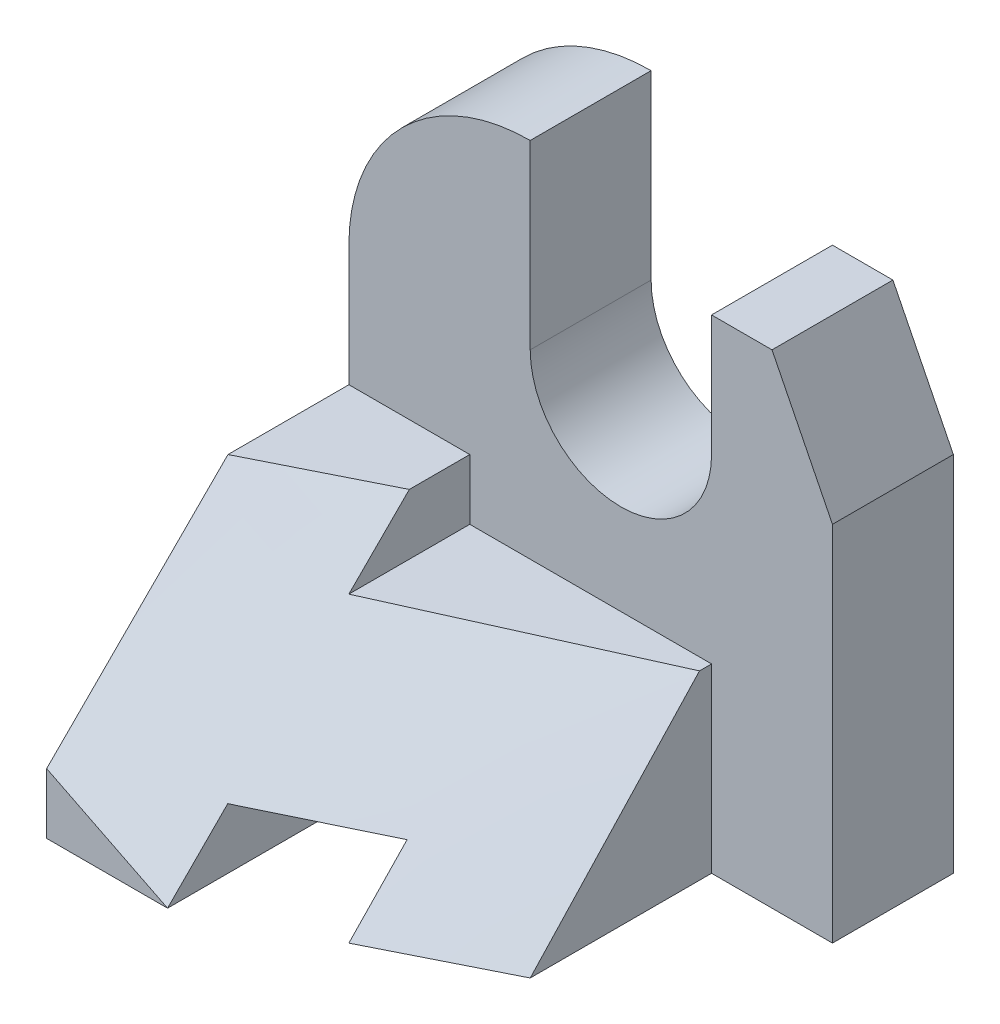
ISO-10303-21;
HEADER;
FILE_DESCRIPTION(('STEP AP214'),'2;1');
FILE_NAME('part.step','',(''),(''),'','','');
FILE_SCHEMA(('AUTOMOTIVE_DESIGN { 1 0 10303 214 1 1 1 1 }'));
ENDSEC;
DATA;
#1=APPLICATION_CONTEXT('core data for automotive mechanical design processes');
#2=APPLICATION_PROTOCOL_DEFINITION('international standard','automotive_design',2000,#1);
#3=PRODUCT_CONTEXT('',#1,'mechanical');
#4=PRODUCT('Part','Part','',(#3));
#5=PRODUCT_RELATED_PRODUCT_CATEGORY('part','',(#4));
#6=PRODUCT_DEFINITION_FORMATION('','',#4);
#7=PRODUCT_DEFINITION_CONTEXT('part definition',#1,'design');
#8=PRODUCT_DEFINITION('design','',#6,#7);
#9=PRODUCT_DEFINITION_SHAPE('','',#8);
#10=(LENGTH_UNIT() NAMED_UNIT(*) SI_UNIT(.MILLI.,.METRE.));
#11=(NAMED_UNIT(*) PLANE_ANGLE_UNIT() SI_UNIT($,.RADIAN.));
#12=(NAMED_UNIT(*) SI_UNIT($,.STERADIAN.) SOLID_ANGLE_UNIT());
#13=UNCERTAINTY_MEASURE_WITH_UNIT(LENGTH_MEASURE(1.E-05),#10,'distance_accuracy_value','');
#14=(GEOMETRIC_REPRESENTATION_CONTEXT(3) GLOBAL_UNCERTAINTY_ASSIGNED_CONTEXT((#13)) GLOBAL_UNIT_ASSIGNED_CONTEXT((#10,
#11,#12)) REPRESENTATION_CONTEXT('',''));
#15=CARTESIAN_POINT('',(0.,0.,0.));
#16=DIRECTION('',(0.,0.,1.));
#17=DIRECTION('',(1.,0.,0.));
#18=AXIS2_PLACEMENT_3D('',#15,#16,#17);
#19=CARTESIAN_POINT('',(0.,0.,-2.));
#20=DIRECTION('',(-1.,0.,0.));
#21=DIRECTION('',(0.,0.,1.));
#22=AXIS2_PLACEMENT_3D('',#19,#20,#21);
#23=PLANE('',#22);
#24=DIRECTION('',(0.,-1.,0.));
#25=VECTOR('',#24,1.);
#26=CARTESIAN_POINT('',(0.,4.,5.));
#27=LINE('',#26,#25);
#28=CARTESIAN_POINT('',(0.,1.00011072459042,5.));
#29=VERTEX_POINT('',#28);
#30=CARTESIAN_POINT('',(0.,0.,5.));
#31=VERTEX_POINT('',#30);
#32=EDGE_CURVE('E215',#29,#31,#27,.T.);
#33=ORIENTED_EDGE('',*,*,#32,.F.);
#34=CARTESIAN_POINT('',(0.000161207109679883,4.00032591672262,2.00033292172915));
#35=CARTESIAN_POINT('',(-8.70748542080413E-05,3.8748208885301,2.12482324464586));
#36=CARTESIAN_POINT('',(-0.000150147520431066,3.74969417233962,2.24969218872042));
#37=CARTESIAN_POINT('',(-0.000133600886381143,3.49972922410863,2.49972476150458));
#38=CARTESIAN_POINT('',(-5.3978227827322E-05,3.37489099892688,2.6248883970804));
#39=CARTESIAN_POINT('',(2.02224500339157E-05,3.12504151441377,2.87504113285717));
#40=CARTESIAN_POINT('',(1.48009852519153E-05,3.0000302561367,3.00003023411232));
#41=CARTESIAN_POINT('',(6.44237481719151E-07,2.75000130898481,3.25000132395382));
#42=CARTESIAN_POINT('',(-8.09103651668495E-06,2.62498362012835,3.37498331255854));
#43=CARTESIAN_POINT('',(-2.084370382305E-05,2.37495783048475,3.6249569832379));
#44=CARTESIAN_POINT('',(-2.48610951967179E-05,2.24994972970157,3.74994866531649));
#45=CARTESIAN_POINT('',(-3.41480072590862E-05,1.99993093789917,3.99992950237374));
#46=CARTESIAN_POINT('',(-3.9417528269529E-05,1.87492024687929,4.12491865735174));
#47=CARTESIAN_POINT('',(-4.0730232598206E-05,1.62491751996357,4.37491601936707));
#48=CARTESIAN_POINT('',(-3.67734014283617E-05,1.49992548409731,4.499924226434));
#49=CARTESIAN_POINT('',(-1.03988304271188E-05,1.2499787352756,4.7499787656724));
#50=CARTESIAN_POINT('',(1.2018970142933E-05,1.12502402244429,4.87502509796795));
#51=CARTESIAN_POINT('',(4.82845584500575E-05,1.00009761818244,5.00009971631353));
#52=B_SPLINE_CURVE_WITH_KNOTS('',3,(#34,#35,#36,#37,#38,#39,#40,#41,#42,#43,#44,#45,#46,#47,#48,
#49,#50,#51),.UNSPECIFIED.,.F.,.F.,(4,2,2,2,2,2,2,2,4),(0.,0.530321583229897,1.06065564754297,
1.5909864946455,2.12131590306239,2.6516455289099,3.18197529102901,3.71230588592193,
4.24263822566876),.UNSPECIFIED.);
#53=CARTESIAN_POINT('',(0.,4.,2.00036833737386));
#54=VERTEX_POINT('',#53);
#55=EDGE_CURVE('E52',#54,#29,#52,.T.);
#56=ORIENTED_EDGE('',*,*,#55,.F.);
#57=DIRECTION('',(0.,0.,-1.));
#58=VECTOR('',#57,1.);
#59=CARTESIAN_POINT('',(0.,4.,5.));
#60=LINE('',#59,#58);
#61=CARTESIAN_POINT('',(0.,4.,0.));
#62=VERTEX_POINT('',#61);
#63=EDGE_CURVE('E230',#54,#62,#60,.T.);
#64=ORIENTED_EDGE('',*,*,#63,.T.);
#65=DIRECTION('',(0.,-1.,0.));
#66=VECTOR('',#65,1.);
#67=CARTESIAN_POINT('',(0.,0.,0.));
#68=LINE('',#67,#66);
#69=CARTESIAN_POINT('',(0.,6.,0.));
#70=VERTEX_POINT('',#69);
#71=EDGE_CURVE('E276',#70,#62,#68,.T.);
#72=ORIENTED_EDGE('',*,*,#71,.F.);
#73=DIRECTION('',(0.,0.,1.));
#74=VECTOR('',#73,1.);
#75=CARTESIAN_POINT('',(0.,6.,-2.));
#76=LINE('',#75,#74);
#77=CARTESIAN_POINT('',(0.,6.,-2.));
#78=VERTEX_POINT('',#77);
#79=EDGE_CURVE('E44',#78,#70,#76,.T.);
#80=ORIENTED_EDGE('',*,*,#79,.F.);
#81=DIRECTION('',(0.,-1.,0.));
#82=VECTOR('',#81,1.);
#83=CARTESIAN_POINT('',(0.,0.,-2.));
#84=LINE('',#83,#82);
#85=CARTESIAN_POINT('',(0.,0.,-2.));
#86=VERTEX_POINT('',#85);
#87=EDGE_CURVE('E309',#78,#86,#84,.T.);
#88=ORIENTED_EDGE('',*,*,#87,.T.);
#89=DIRECTION('',(0.,0.,1.));
#90=VECTOR('',#89,1.);
#91=CARTESIAN_POINT('',(0.,0.,-2.));
#92=LINE('',#91,#90);
#93=EDGE_CURVE('E11',#86,#31,#92,.T.);
#94=ORIENTED_EDGE('',*,*,#93,.T.);
#95=EDGE_LOOP('',(#33,#56,#64,#72,#80,#88,#94));
#96=FACE_BOUND('',#95,.T.);
#97=ADVANCED_FACE('F33',(#96),#23,.T.);
#98=CARTESIAN_POINT('',(8.,0.,-2.));
#99=DIRECTION('',(0.,-1.,0.));
#100=DIRECTION('',(1.,0.,0.));
#101=AXIS2_PLACEMENT_3D('',#98,#99,#100);
#102=PLANE('',#101);
#103=DIRECTION('',(0.,0.,-1.));
#104=VECTOR('',#103,1.);
#105=CARTESIAN_POINT('',(6.,0.,5.));
#106=LINE('',#105,#104);
#107=CARTESIAN_POINT('',(6.,0.,2.99974245718688));
#108=VERTEX_POINT('',#107);
#109=CARTESIAN_POINT('',(6.,0.,0.));
#110=VERTEX_POINT('',#109);
#111=EDGE_CURVE('E187',#108,#110,#106,.T.);
#112=ORIENTED_EDGE('',*,*,#111,.F.);
#113=CARTESIAN_POINT('',(4.00000000658737,1.33178588701533E-08,4.0000000136041));
#114=CARTESIAN_POINT('',(4.08333755503595,8.52401197638786E-06,3.95834203780456));
#115=CARTESIAN_POINT('',(4.16667490731874,1.66480328938494E-05,3.9166836694744));
#116=CARTESIAN_POINT('',(4.33334909258258,3.18461884844197E-05,3.83336586036238));
#117=CARTESIAN_POINT('',(4.41668592556354,3.89203229891458E-05,3.79170641958035));
#118=CARTESIAN_POINT('',(4.58335893461497,5.17421642406971E-05,3.70838618349126));
#119=CARTESIAN_POINT('',(4.66669511068531,5.74898707313747E-05,3.66672538818393));
#120=CARTESIAN_POINT('',(4.83336686211137,6.77711544135049E-05,3.58340255743135));
#121=CARTESIAN_POINT('',(4.91670243746697,7.23047313813082E-05,3.54174052198586));
#122=CARTESIAN_POINT('',(5.08337308329097,8.03494551687727E-05,3.45841540627238));
#123=CARTESIAN_POINT('',(5.16670815375928,8.38606018176107E-05,3.41675232600421));
#124=CARTESIAN_POINT('',(5.33337769355762,8.96642436279205E-05,3.33342491980399));
#125=CARTESIAN_POINT('',(5.41671216288752,9.1956738536444E-05,3.29176059387168));
#126=CARTESIAN_POINT('',(5.58338002481438,9.43525023961884E-05,3.20842970266921));
#127=CARTESIAN_POINT('',(5.66671341741088,9.44557704495083E-05,3.16676313739815));
#128=CARTESIAN_POINT('',(5.83337726039701,8.87139680875217E-05,3.08342393066843));
#129=CARTESIAN_POINT('',(5.91670771078384,8.28688921640685E-05,3.04175128920419));
#130=CARTESIAN_POINT('',(6.00003569724967,7.21700838231021E-05,3.0000737212528));
#131=B_SPLINE_CURVE_WITH_KNOTS('',3,(#113,#114,#115,#116,#117,#118,#119,#120,#121,#122,#123,
#124,#125,#126,#127,#128,#129,#130),.UNSPECIFIED.,.F.,.F.,(4,2,2,2,2,2,2,2,4),(0.,
0.279508150185694,0.559016345199323,0.838524594188939,1.11803289466546,1.39754124184095,
1.67704964703228,1.95655816686265,2.23606694551723),.UNSPECIFIED.);
#132=CARTESIAN_POINT('',(4.00000000263495,5.32714370662588E-09,4.00000000544164));
#133=VERTEX_POINT('',#132);
#134=EDGE_CURVE('E166',#133,#108,#131,.T.);
#135=ORIENTED_EDGE('',*,*,#134,.F.);
#136=DIRECTION('',(0.,0.,1.));
#137=VECTOR('',#136,1.);
#138=CARTESIAN_POINT('',(4.,0.,-2.));
#139=LINE('',#138,#137);
#140=CARTESIAN_POINT('',(4.,0.,-2.));
#141=VERTEX_POINT('',#140);
#142=EDGE_CURVE('E343',#141,#133,#139,.T.);
#143=ORIENTED_EDGE('',*,*,#142,.F.);
#144=DIRECTION('',(1.,0.,0.));
#145=VECTOR('',#144,1.);
#146=CARTESIAN_POINT('',(8.,0.,-2.));
#147=LINE('',#146,#145);
#148=CARTESIAN_POINT('',(8.,0.,-2.));
#149=VERTEX_POINT('',#148);
#150=EDGE_CURVE('E285',#141,#149,#147,.T.);
#151=ORIENTED_EDGE('',*,*,#150,.T.);
#152=DIRECTION('',(0.,0.,1.));
#153=VECTOR('',#152,1.);
#154=CARTESIAN_POINT('',(8.,0.,-2.));
#155=LINE('',#154,#153);
#156=CARTESIAN_POINT('',(8.,0.,0.));
#157=VERTEX_POINT('',#156);
#158=EDGE_CURVE('E341',#149,#157,#155,.T.);
#159=ORIENTED_EDGE('',*,*,#158,.T.);
#160=DIRECTION('',(1.,0.,0.));
#161=VECTOR('',#160,1.);
#162=CARTESIAN_POINT('',(8.,0.,0.));
#163=LINE('',#162,#161);
#164=EDGE_CURVE('E196',#110,#157,#163,.T.);
#165=ORIENTED_EDGE('',*,*,#164,.F.);
#166=EDGE_LOOP('',(#112,#135,#143,#151,#159,#165));
#167=FACE_BOUND('',#166,.T.);
#168=ADVANCED_FACE('F194',(#167),#102,.T.);
#169=CARTESIAN_POINT('',(4.,1.,-2.));
#170=DIRECTION('',(-1.,0.,0.));
#171=DIRECTION('',(0.,0.,1.));
#172=AXIS2_PLACEMENT_3D('',#169,#170,#171);
#173=PLANE('',#172);
#174=ORIENTED_EDGE('',*,*,#142,.T.);
#175=CARTESIAN_POINT('',(4.,0.,4.00000002980032));
#176=CARTESIAN_POINT('',(4.,0.0830768448448193,3.91950210453213));
#177=CARTESIAN_POINT('',(4.,0.166228998184829,3.83908195098269));
#178=CARTESIAN_POINT('',(4.,0.332668683019209,3.67838219701719));
#179=CARTESIAN_POINT('',(4.,0.415956214230219,3.59810259630767));
#180=CARTESIAN_POINT('',(4.,0.582651747515637,3.43766863660996));
#181=CARTESIAN_POINT('',(4.,0.666059749567043,3.35751427759786));
#182=CARTESIAN_POINT('',(4.,0.83296791855962,3.19730121540335));
#183=CARTESIAN_POINT('',(4.,0.91646808569309,3.11724251242126));
#184=CARTESIAN_POINT('',(4.00000000000001,1.,3.03721701965413));
#185=B_SPLINE_CURVE_WITH_KNOTS('',3,(#175,#176,#177,#178,#179,#180,#181,#182,#183,#184),
.UNSPECIFIED.,.F.,.F.,(4,2,2,2,4),(0.,0.347037511652203,0.69407429784966,1.04111101779322,
1.38814846319167),.UNSPECIFIED.);
#186=CARTESIAN_POINT('',(4.,1.,3.03721701965413));
#187=VERTEX_POINT('',#186);
#188=EDGE_CURVE('E174',#133,#187,#185,.T.);
#189=ORIENTED_EDGE('',*,*,#188,.T.);
#190=DIRECTION('',(0.,0.,1.));
#191=VECTOR('',#190,1.);
#192=CARTESIAN_POINT('',(4.,1.,-2.));
#193=LINE('',#192,#191);
#194=CARTESIAN_POINT('',(4.,1.,-2.));
#195=VERTEX_POINT('',#194);
#196=EDGE_CURVE('E345',#195,#187,#193,.T.);
#197=ORIENTED_EDGE('',*,*,#196,.F.);
#198=DIRECTION('',(0.,-1.,0.));
#199=VECTOR('',#198,1.);
#200=CARTESIAN_POINT('',(4.,1.,-2.));
#201=LINE('',#200,#199);
#202=EDGE_CURVE('E282',#195,#141,#201,.T.);
#203=ORIENTED_EDGE('',*,*,#202,.T.);
#204=EDGE_LOOP('',(#174,#189,#197,#203));
#205=FACE_BOUND('',#204,.T.);
#206=ADVANCED_FACE('F362',(#205),#173,.T.);
#207=CARTESIAN_POINT('',(2.,1.,-2.));
#208=DIRECTION('',(0.,-1.,0.));
#209=DIRECTION('',(0.,0.,-1.));
#210=AXIS2_PLACEMENT_3D('',#207,#208,#209);
#211=PLANE('',#210);
#212=ORIENTED_EDGE('',*,*,#196,.T.);
#213=CARTESIAN_POINT('',(4.,1.,3.03721701965413));
#214=CARTESIAN_POINT('',(3.83317542959914,1.,3.11743675421449));
#215=CARTESIAN_POINT('',(3.66629841694291,1.,3.19754754200068));
#216=CARTESIAN_POINT('',(3.33258330217989,1.,3.35784822255746));
#217=CARTESIAN_POINT('',(3.16574519990884,1.,3.43803811498633));
#218=CARTESIAN_POINT('',(2.83225001478325,1.,3.59879480818127));
#219=CARTESIAN_POINT('',(2.66559293219904,1.,3.67936160950925));
#220=CARTESIAN_POINT('',(2.33256009502068,1.,3.84107609590735));
#221=CARTESIAN_POINT('',(2.16618434163963,1.,3.92222378347442));
#222=CARTESIAN_POINT('',(2.,1.,4.00376361602445));
#223=B_SPLINE_CURVE_WITH_KNOTS('',3,(#213,#214,#215,#216,#217,#218,#219,#220,#221,#222),
.UNSPECIFIED.,.F.,.F.,(4,2,2,2,4),(0.,0.555329578273566,1.11065676801888,1.66598478593238,
2.22131519237057),.UNSPECIFIED.);
#224=CARTESIAN_POINT('',(2.,1.,4.00376361602445));
#225=VERTEX_POINT('',#224);
#226=EDGE_CURVE('E427',#187,#225,#223,.T.);
#227=ORIENTED_EDGE('',*,*,#226,.T.);
#228=DIRECTION('',(0.,0.,1.));
#229=VECTOR('',#228,1.);
#230=CARTESIAN_POINT('',(2.,1.,-2.));
#231=LINE('',#230,#229);
#232=CARTESIAN_POINT('',(2.,1.,-2.));
#233=VERTEX_POINT('',#232);
#234=EDGE_CURVE('E318',#233,#225,#231,.T.);
#235=ORIENTED_EDGE('',*,*,#234,.F.);
#236=DIRECTION('',(1.,0.,0.));
#237=VECTOR('',#236,1.);
#238=CARTESIAN_POINT('',(2.,1.,-2.));
#239=LINE('',#238,#237);
#240=EDGE_CURVE('E279',#233,#195,#239,.T.);
#241=ORIENTED_EDGE('',*,*,#240,.T.);
#242=EDGE_LOOP('',(#212,#227,#235,#241));
#243=FACE_BOUND('',#242,.T.);
#244=ADVANCED_FACE('F368',(#243),#211,.T.);
#245=CARTESIAN_POINT('',(2.,0.,-2.));
#246=DIRECTION('',(1.,0.,0.));
#247=DIRECTION('',(0.,0.,-1.));
#248=AXIS2_PLACEMENT_3D('',#245,#246,#247);
#249=PLANE('',#248);
#250=ORIENTED_EDGE('',*,*,#234,.T.);
#251=CARTESIAN_POINT('',(2.,1.,4.00376361602445));
#252=CARTESIAN_POINT('',(2.,0.666666666666666,4.33577798385316));
#253=CARTESIAN_POINT('',(2.,0.333333333333331,4.66779235168187));
#254=CARTESIAN_POINT('',(2.,0.,4.99980671951058));
#255=B_SPLINE_CURVE_WITH_KNOTS('',3,(#251,#252,#253,#254),.UNSPECIFIED.,.F.,.F.,(4,4),(0.,
1.41141838729779),.UNSPECIFIED.);
#256=CARTESIAN_POINT('',(1.99999443737516,0.,4.99990862702491));
#257=VERTEX_POINT('',#256);
#258=EDGE_CURVE('E179',#225,#257,#255,.T.);
#259=ORIENTED_EDGE('',*,*,#258,.T.);
#260=DIRECTION('',(0.,0.,1.));
#261=VECTOR('',#260,1.);
#262=CARTESIAN_POINT('',(2.,0.,-2.));
#263=LINE('',#262,#261);
#264=CARTESIAN_POINT('',(2.,0.,-2.));
#265=VERTEX_POINT('',#264);
#266=EDGE_CURVE('E312',#265,#257,#263,.T.);
#267=ORIENTED_EDGE('',*,*,#266,.F.);
#268=DIRECTION('',(0.,1.,0.));
#269=VECTOR('',#268,1.);
#270=CARTESIAN_POINT('',(2.,0.,-2.));
#271=LINE('',#270,#269);
#272=EDGE_CURVE('E275',#265,#233,#271,.T.);
#273=ORIENTED_EDGE('',*,*,#272,.T.);
#274=EDGE_LOOP('',(#250,#259,#267,#273));
#275=FACE_BOUND('',#274,.T.);
#276=ADVANCED_FACE('F438',(#275),#249,.T.);
#277=CARTESIAN_POINT('',(6.,0.,5.));
#278=DIRECTION('',(-1.,0.,0.));
#279=DIRECTION('',(0.,0.,1.));
#280=AXIS2_PLACEMENT_3D('',#277,#278,#279);
#281=PLANE('',#280);
#282=CARTESIAN_POINT('',(6.00003569724967,7.21700838224092E-05,3.0000737212528));
#283=CARTESIAN_POINT('',(5.9999663052207,0.124934053161901,2.88325711398926));
#284=CARTESIAN_POINT('',(5.99995070152583,0.249901980075695,2.76655411080573));
#285=CARTESIAN_POINT('',(5.99996420301007,0.499928223040762,2.53324043630837));
#286=CARTESIAN_POINT('',(5.99999330899141,0.624986540673685,2.41662976668887));
#287=CARTESIAN_POINT('',(6.00003335995744,0.87506703695138,2.18337038261943));
#288=CARTESIAN_POINT('',(6.00004430499147,1.00008921569344,2.06672166827374));
#289=CARTESIAN_POINT('',(6.00005410570267,1.25010915478673,1.83339925142854));
#290=CARTESIAN_POINT('',(6.00005296143682,1.37510691525025,1.71672554904936));
#291=CARTESIAN_POINT('',(6.00004728832248,1.62509554499609,1.48337119976784));
#292=CARTESIAN_POINT('',(6.00004275947989,1.75008641429003,1.36669055287793));
#293=CARTESIAN_POINT('',(6.00003336996312,2.00006762718836,1.13332843829637));
#294=CARTESIAN_POINT('',(6.0000285092886,2.12505797079209,1.016646970604));
#295=CARTESIAN_POINT('',(6.00003886240315,2.37507860726888,0.783326086050125));
#296=CARTESIAN_POINT('',(6.00005407625179,2.50010890025937,0.666686669314432));
#297=CARTESIAN_POINT('',(6.00004869024947,2.750097080772,0.433333874057769));
#298=CARTESIAN_POINT('',(6.00002809090985,2.87505496930246,0.316620496616601));
#299=CARTESIAN_POINT('',(5.99996164225678,2.99992245112525,0.199810296460821));
#300=B_SPLINE_CURVE_WITH_KNOTS('',3,(#282,#283,#284,#285,#286,#287,#288,#289,#290,#291,#292,
#293,#294,#295,#296,#297,#298,#299),.UNSPECIFIED.,.F.,.F.,(4,2,2,2,2,2,2,2,4),(0.,
0.512961207217331,1.02593161868379,1.53890063609428,2.0518672361939,2.56483294425948,
3.07779917985295,3.59076693756888,4.10372737115164),.UNSPECIFIED.);
#301=CARTESIAN_POINT('',(6.,3.,0.199804984205686));
#302=VERTEX_POINT('',#301);
#303=EDGE_CURVE('E170',#108,#302,#300,.T.);
#304=ORIENTED_EDGE('',*,*,#303,.F.);
#305=ORIENTED_EDGE('',*,*,#111,.T.);
#306=DIRECTION('',(0.,1.,0.));
#307=VECTOR('',#306,1.);
#308=CARTESIAN_POINT('',(6.,0.,0.));
#309=LINE('',#308,#307);
#310=CARTESIAN_POINT('',(6.,3.,0.));
#311=VERTEX_POINT('',#310);
#312=EDGE_CURVE('E323',#110,#311,#309,.T.);
#313=ORIENTED_EDGE('',*,*,#312,.T.);
#314=DIRECTION('',(0.,0.,-1.));
#315=VECTOR('',#314,1.);
#316=CARTESIAN_POINT('',(6.,3.,5.));
#317=LINE('',#316,#315);
#318=EDGE_CURVE('E189',#302,#311,#317,.T.);
#319=ORIENTED_EDGE('',*,*,#318,.F.);
#320=EDGE_LOOP('',(#304,#305,#313,#319));
#321=FACE_BOUND('',#320,.T.);
#322=ADVANCED_FACE('F185',(#321),#281,.F.);
#323=CARTESIAN_POINT('',(6.,3.,5.));
#324=DIRECTION('',(0.,-1.,0.));
#325=DIRECTION('',(0.,0.,-1.));
#326=AXIS2_PLACEMENT_3D('',#323,#324,#325);
#327=PLANE('',#326);
#328=CARTESIAN_POINT('',(5.99996164225678,2.99992245112525,0.199810296460821));
#329=CARTESIAN_POINT('',(5.83329132696436,2.99991470447445,0.274806904582816));
#330=CARTESIAN_POINT('',(5.66662405256221,2.99991348834526,0.349810268769717));
#331=CARTESIAN_POINT('',(5.33329532676501,2.99992282861731,0.499829022704072));
#332=CARTESIAN_POINT('',(5.16663387535874,2.99993338499444,0.574844412426582));
#333=CARTESIAN_POINT('',(4.83331613932615,2.99996498171812,0.72488590966804));
#334=CARTESIAN_POINT('',(4.66665985469149,2.99998602204673,0.799912017168425));
#335=CARTESIAN_POINT('',(4.33334997944098,3.00003367147151,0.949969947828286));
#336=CARTESIAN_POINT('',(4.16669638882368,3.00006028056456,1.02500177098454));
#337=CARTESIAN_POINT('',(3.83338237422125,3.00010015820654,1.17505189567828));
#338=CARTESIAN_POINT('',(3.66672195021388,3.00011342670789,1.25007019716659));
#339=CARTESIAN_POINT('',(3.33336338345372,3.00006435711618,1.40002971329459));
#340=CARTESIAN_POINT('',(3.16666524015249,3.00000201784229,1.47497092671206));
#341=CARTESIAN_POINT('',(2.83316753849596,2.99966395311703,1.62463352174489));
#342=CARTESIAN_POINT('',(2.6663679789467,2.99938822510285,1.69935490070921));
#343=CARTESIAN_POINT('',(2.33303299064084,2.99937077389548,1.84934314196292));
#344=CARTESIAN_POINT('',(2.16649753974268,2.99962900328016,1.9246099552193));
#345=CARTESIAN_POINT('',(2.00026105623664,3.00052778437151,2.00053912816797));
#346=B_SPLINE_CURVE_WITH_KNOTS('',3,(#328,#329,#330,#331,#332,#333,#334,#335,#336,#337,#338,
#339,#340,#341,#342,#343,#344,#345),.UNSPECIFIED.,.F.,.F.,(4,2,2,2,2,2,2,2,4),(0.,
0.548298609430597,1.09659609597028,1.64489264419368,2.19318888583376,2.74148708243618,
3.2897938422599,3.83810718736393,4.38637183744746),.UNSPECIFIED.);
#347=CARTESIAN_POINT('',(2.,3.,2.00059483053786));
#348=VERTEX_POINT('',#347);
#349=EDGE_CURVE('E190',#302,#348,#346,.T.);
#350=ORIENTED_EDGE('',*,*,#349,.F.);
#351=ORIENTED_EDGE('',*,*,#318,.T.);
#352=DIRECTION('',(-1.,0.,0.));
#353=VECTOR('',#352,1.);
#354=CARTESIAN_POINT('',(6.,3.,0.));
#355=LINE('',#354,#353);
#356=CARTESIAN_POINT('',(2.,3.,0.));
#357=VERTEX_POINT('',#356);
#358=EDGE_CURVE('E557',#311,#357,#355,.T.);
#359=ORIENTED_EDGE('',*,*,#358,.T.);
#360=DIRECTION('',(0.,0.,-1.));
#361=VECTOR('',#360,1.);
#362=CARTESIAN_POINT('',(2.,3.,5.));
#363=LINE('',#362,#361);
#364=EDGE_CURVE('E199',#348,#357,#363,.T.);
#365=ORIENTED_EDGE('',*,*,#364,.F.);
#366=EDGE_LOOP('',(#350,#351,#359,#365));
#367=FACE_BOUND('',#366,.T.);
#368=ADVANCED_FACE('F257',(#367),#327,.F.);
#369=CARTESIAN_POINT('',(2.,3.,5.));
#370=DIRECTION('',(-1.,0.,0.));
#371=DIRECTION('',(0.,0.,1.));
#372=AXIS2_PLACEMENT_3D('',#369,#370,#371);
#373=PLANE('',#372);
#374=CARTESIAN_POINT('',(2.00026105623664,3.00052778437151,2.00053912816797));
#375=CARTESIAN_POINT('',(2.00023106367735,3.04213368761931,1.95881064812215));
#376=CARTESIAN_POINT('',(2.0002065855731,3.08375087561613,1.91709342039173));
#377=CARTESIAN_POINT('',(2.00016662047752,3.16700342918406,1.8336775331982));
#378=CARTESIAN_POINT('',(2.00015113343962,3.20863879465989,1.79197887364002));
#379=CARTESIAN_POINT('',(2.00012711245752,3.29192358139359,1.70859591538839));
#380=CARTESIAN_POINT('',(2.00011857848643,3.33357300259649,1.66691161664003));
#381=CARTESIAN_POINT('',(2.00010653438562,3.41688200048406,1.58355339563352));
#382=CARTESIAN_POINT('',(2.00010302424218,3.45854157714072,1.54187947334738));
#383=CARTESIAN_POINT('',(2.00009934309266,3.54186747955726,1.45853852641536));
#384=CARTESIAN_POINT('',(2.00009917208057,3.58353380530491,1.41687150175725));
#385=CARTESIAN_POINT('',(2.00010087272911,3.66687058479905,1.33354167265536));
#386=CARTESIAN_POINT('',(2.00010274438747,3.70854103854095,1.29187886820698));
#387=CARTESIAN_POINT('',(2.00010767958044,3.7918843527374,1.20855572368482));
#388=CARTESIAN_POINT('',(2.00011074311423,3.83355721319028,1.16689538360937));
#389=CARTESIAN_POINT('',(2.00011802400207,3.91690526680533,1.08357708630521));
#390=CARTESIAN_POINT('',(2.00012224135544,3.95858045996611,1.04191912907511));
#391=CARTESIAN_POINT('',(2.00012701659245,4.00025679284004,1.00026231215032));
#392=B_SPLINE_CURVE_WITH_KNOTS('',3,(#374,#375,#376,#377,#378,#379,#380,#381,#382,#383,#384,
#385,#386,#387,#388,#389,#390,#391),.UNSPECIFIED.,.F.,.F.,(4,2,2,2,2,2,2,2,4),(0.,
0.176779129581848,0.353557343388286,0.530334873640979,0.707111921800777,0.883888652814245,
1.06066518936698,1.23744160508056,1.41421791643286),.UNSPECIFIED.);
#393=CARTESIAN_POINT('',(2.,4.,1.00029066476479));
#394=VERTEX_POINT('',#393);
#395=EDGE_CURVE('E556',#348,#394,#392,.T.);
#396=ORIENTED_EDGE('',*,*,#395,.F.);
#397=ORIENTED_EDGE('',*,*,#364,.T.);
#398=DIRECTION('',(0.,1.,0.));
#399=VECTOR('',#398,1.);
#400=CARTESIAN_POINT('',(2.,3.,0.));
#401=LINE('',#400,#399);
#402=CARTESIAN_POINT('',(2.,4.,0.));
#403=VERTEX_POINT('',#402);
#404=EDGE_CURVE('E216',#357,#403,#401,.T.);
#405=ORIENTED_EDGE('',*,*,#404,.T.);
#406=DIRECTION('',(0.,0.,-1.));
#407=VECTOR('',#406,1.);
#408=CARTESIAN_POINT('',(2.,4.,5.));
#409=LINE('',#408,#407);
#410=EDGE_CURVE('E61',#394,#403,#409,.T.);
#411=ORIENTED_EDGE('',*,*,#410,.F.);
#412=EDGE_LOOP('',(#396,#397,#405,#411));
#413=FACE_BOUND('',#412,.T.);
#414=ADVANCED_FACE('F251',(#413),#373,.F.);
#415=CARTESIAN_POINT('',(2.,4.,5.));
#416=DIRECTION('',(0.,-1.,0.));
#417=DIRECTION('',(0.,0.,-1.));
#418=AXIS2_PLACEMENT_3D('',#415,#416,#417);
#419=PLANE('',#418);
#420=CARTESIAN_POINT('',(2.00012701659245,4.00025679284004,1.00026231215032));
#421=CARTESIAN_POINT('',(1.91663704188144,3.9999426485297,1.04160871113607));
#422=CARTESIAN_POINT('',(1.83322103049211,3.99977509883147,1.08310412867022));
#423=CARTESIAN_POINT('',(1.66647009642934,3.99960393870713,1.16626242660867));
#424=CARTESIAN_POINT('',(1.58313517547372,3.99960033168152,1.20792531046863));
#425=CARTESIAN_POINT('',(1.41648239760115,3.99962780936508,1.29128656327078));
#426=CARTESIAN_POINT('',(1.33316454082123,3.99965889434273,1.33298493248509));
#427=CARTESIAN_POINT('',(1.16652745393708,3.99971846180564,1.41637905551638));
#428=CARTESIAN_POINT('',(1.08320822383238,3.99974694429,1.45807480933246));
#429=CARTESIAN_POINT('',(0.916564101102666,3.99979253729715,1.54145471940505));
#430=CARTESIAN_POINT('',(0.833239208485254,3.99980964783491,1.58313887567674));
#431=CARTESIAN_POINT('',(0.666588910661748,3.99984286801782,1.66650617457534));
#432=CARTESIAN_POINT('',(0.583263505455616,3.9998589776629,1.70818931720218));
#433=CARTESIAN_POINT('',(0.416621543800783,3.99990924002552,1.79157407124629));
#434=CARTESIAN_POINT('',(0.333304987385586,3.99994339280911,1.83327568273062));
#435=CARTESIAN_POINT('',(0.1667033986068,4.0000754314226,1.91674400858235));
#436=CARTESIAN_POINT('',(0.0834183666033845,4.00017331795992,1.95851072366725));
#437=CARTESIAN_POINT('',(0.000161207109680718,4.00032591672262,2.00033292172915));
#438=B_SPLINE_CURVE_WITH_KNOTS('',3,(#420,#421,#422,#423,#424,#425,#426,#427,#428,#429,#430,
#431,#432,#433,#434,#435,#436,#437),.UNSPECIFIED.,.F.,.F.,(4,2,2,2,2,2,2,2,4),(0.,
0.2795016352495,0.559009067900931,0.838518663569686,1.11802835642197,1.39753768155196,
1.67704702653647,1.95655739461351,2.23607086518479),.UNSPECIFIED.);
#439=EDGE_CURVE('E234',#394,#54,#438,.T.);
#440=ORIENTED_EDGE('',*,*,#439,.F.);
#441=ORIENTED_EDGE('',*,*,#410,.T.);
#442=DIRECTION('',(-1.,0.,0.));
#443=VECTOR('',#442,1.);
#444=CARTESIAN_POINT('',(2.,4.,0.));
#445=LINE('',#444,#443);
#446=EDGE_CURVE('E212',#403,#62,#445,.T.);
#447=ORIENTED_EDGE('',*,*,#446,.T.);
#448=ORIENTED_EDGE('',*,*,#63,.F.);
#449=EDGE_LOOP('',(#440,#441,#447,#448));
#450=FACE_BOUND('',#449,.T.);
#451=ADVANCED_FACE('F240',(#450),#419,.F.);
#452=CARTESIAN_POINT('',(3.,6.,0.));
#453=DIRECTION('',(0.,0.,-1.));
#454=DIRECTION('',(-1.,0.,0.));
#455=AXIS2_PLACEMENT_3D('',#452,#453,#454);
#456=PLANE('',#455);
#457=ORIENTED_EDGE('',*,*,#446,.F.);
#458=ORIENTED_EDGE('',*,*,#404,.F.);
#459=ORIENTED_EDGE('',*,*,#358,.F.);
#460=ORIENTED_EDGE('',*,*,#312,.F.);
#461=ORIENTED_EDGE('',*,*,#164,.T.);
#462=DIRECTION('',(0.,1.,0.));
#463=VECTOR('',#462,1.);
#464=CARTESIAN_POINT('',(8.,6.,0.));
#465=LINE('',#464,#463);
#466=CARTESIAN_POINT('',(8.,6.,0.));
#467=VERTEX_POINT('',#466);
#468=EDGE_CURVE('E197',#157,#467,#465,.T.);
#469=ORIENTED_EDGE('',*,*,#468,.T.);
#470=DIRECTION('',(-0.447213595499958,0.894427190999916,0.));
#471=VECTOR('',#470,1.);
#472=CARTESIAN_POINT('',(7.,8.,0.));
#473=LINE('',#472,#471);
#474=CARTESIAN_POINT('',(7.,8.,0.));
#475=VERTEX_POINT('',#474);
#476=EDGE_CURVE('E482',#467,#475,#473,.T.);
#477=ORIENTED_EDGE('',*,*,#476,.T.);
#478=DIRECTION('',(-1.,0.,0.));
#479=VECTOR('',#478,1.);
#480=CARTESIAN_POINT('',(6.,8.,0.));
#481=LINE('',#480,#479);
#482=CARTESIAN_POINT('',(6.,8.,0.));
#483=VERTEX_POINT('',#482);
#484=EDGE_CURVE('E480',#475,#483,#481,.T.);
#485=ORIENTED_EDGE('',*,*,#484,.T.);
#486=DIRECTION('',(0.,-1.,0.));
#487=VECTOR('',#486,1.);
#488=CARTESIAN_POINT('',(6.,6.,0.));
#489=LINE('',#488,#487);
#490=CARTESIAN_POINT('',(6.,6.,0.));
#491=VERTEX_POINT('',#490);
#492=EDGE_CURVE('E475',#483,#491,#489,.T.);
#493=ORIENTED_EDGE('',*,*,#492,.T.);
#494=CARTESIAN_POINT('',(4.5,6.,0.));
#495=DIRECTION('',(0.,0.,-1.));
#496=DIRECTION('',(1.,0.,0.));
#497=AXIS2_PLACEMENT_3D('',#494,#495,#496);
#498=CIRCLE('',#497,1.5);
#499=CARTESIAN_POINT('',(3.,6.,0.));
#500=VERTEX_POINT('',#499);
#501=EDGE_CURVE('E474',#491,#500,#498,.T.);
#502=ORIENTED_EDGE('',*,*,#501,.T.);
#503=DIRECTION('',(0.,1.,0.));
#504=VECTOR('',#503,1.);
#505=CARTESIAN_POINT('',(3.,9.,0.));
#506=LINE('',#505,#504);
#507=CARTESIAN_POINT('',(3.,9.,0.));
#508=VERTEX_POINT('',#507);
#509=EDGE_CURVE('E472',#500,#508,#506,.T.);
#510=ORIENTED_EDGE('',*,*,#509,.T.);
#511=CARTESIAN_POINT('',(3.,6.,0.));
#512=DIRECTION('',(0.,0.,1.));
#513=DIRECTION('',(-1.,0.,0.));
#514=AXIS2_PLACEMENT_3D('',#511,#512,#513);
#515=CIRCLE('',#514,3.);
#516=EDGE_CURVE('E322',#508,#70,#515,.T.);
#517=ORIENTED_EDGE('',*,*,#516,.T.);
#518=ORIENTED_EDGE('',*,*,#71,.T.);
#519=EDGE_LOOP('',(#457,#458,#459,#460,#461,#469,#477,#485,#493,#502,#510,#517,#518));
#520=FACE_BOUND('',#519,.T.);
#521=ADVANCED_FACE('F250',(#520),#456,.F.);
#522=CARTESIAN_POINT('',(2.,0.,-2.));
#523=DIRECTION('',(0.,-1.,0.));
#524=DIRECTION('',(1.,0.,0.));
#525=AXIS2_PLACEMENT_3D('',#522,#523,#524);
#526=PLANE('',#525);
#527=ORIENTED_EDGE('',*,*,#266,.T.);
#528=DIRECTION('',(1.,0.,0.));
#529=VECTOR('',#528,1.);
#530=CARTESIAN_POINT('',(0.,0.,5.));
#531=LINE('',#530,#529);
#532=EDGE_CURVE('E443',#31,#257,#531,.T.);
#533=ORIENTED_EDGE('',*,*,#532,.F.);
#534=ORIENTED_EDGE('',*,*,#93,.F.);
#535=DIRECTION('',(1.,0.,0.));
#536=VECTOR('',#535,1.);
#537=CARTESIAN_POINT('',(2.,0.,-2.));
#538=LINE('',#537,#536);
#539=EDGE_CURVE('E272',#86,#265,#538,.T.);
#540=ORIENTED_EDGE('',*,*,#539,.T.);
#541=EDGE_LOOP('',(#527,#533,#534,#540));
#542=FACE_BOUND('',#541,.T.);
#543=ADVANCED_FACE('F35',(#542),#526,.T.);
#544=CARTESIAN_POINT('',(3.,6.,-2.));
#545=DIRECTION('',(0.,0.,1.));
#546=DIRECTION('',(1.,0.,0.));
#547=AXIS2_PLACEMENT_3D('',#544,#545,#546);
#548=CYLINDRICAL_SURFACE('',#547,3.);
#549=ORIENTED_EDGE('',*,*,#516,.F.);
#550=DIRECTION('',(0.,0.,1.));
#551=VECTOR('',#550,1.);
#552=CARTESIAN_POINT('',(3.,9.,-2.));
#553=LINE('',#552,#551);
#554=CARTESIAN_POINT('',(3.,9.,-2.));
#555=VERTEX_POINT('',#554);
#556=EDGE_CURVE('E329',#555,#508,#553,.T.);
#557=ORIENTED_EDGE('',*,*,#556,.F.);
#558=CARTESIAN_POINT('',(3.,6.,-2.));
#559=DIRECTION('',(0.,0.,1.));
#560=DIRECTION('',(-1.,0.,0.));
#561=AXIS2_PLACEMENT_3D('',#558,#559,#560);
#562=CIRCLE('',#561,3.);
#563=EDGE_CURVE('E306',#555,#78,#562,.T.);
#564=ORIENTED_EDGE('',*,*,#563,.T.);
#565=ORIENTED_EDGE('',*,*,#79,.T.);
#566=EDGE_LOOP('',(#549,#557,#564,#565));
#567=FACE_BOUND('',#566,.T.);
#568=ADVANCED_FACE('F508',(#567),#548,.T.);
#569=CARTESIAN_POINT('',(3.,9.,-2.));
#570=DIRECTION('',(1.,0.,0.));
#571=DIRECTION('',(0.,0.,-1.));
#572=AXIS2_PLACEMENT_3D('',#569,#570,#571);
#573=PLANE('',#572);
#574=ORIENTED_EDGE('',*,*,#509,.F.);
#575=DIRECTION('',(0.,0.,1.));
#576=VECTOR('',#575,1.);
#577=CARTESIAN_POINT('',(3.,6.,-2.));
#578=LINE('',#577,#576);
#579=CARTESIAN_POINT('',(3.,6.,-2.));
#580=VERTEX_POINT('',#579);
#581=EDGE_CURVE('E331',#580,#500,#578,.T.);
#582=ORIENTED_EDGE('',*,*,#581,.F.);
#583=DIRECTION('',(0.,1.,0.));
#584=VECTOR('',#583,1.);
#585=CARTESIAN_POINT('',(3.,9.,-2.));
#586=LINE('',#585,#584);
#587=EDGE_CURVE('E303',#580,#555,#586,.T.);
#588=ORIENTED_EDGE('',*,*,#587,.T.);
#589=ORIENTED_EDGE('',*,*,#556,.T.);
#590=EDGE_LOOP('',(#574,#582,#588,#589));
#591=FACE_BOUND('',#590,.T.);
#592=ADVANCED_FACE('F506',(#591),#573,.T.);
#593=CARTESIAN_POINT('',(4.5,6.,-2.));
#594=DIRECTION('',(0.,0.,1.));
#595=DIRECTION('',(1.,0.,0.));
#596=AXIS2_PLACEMENT_3D('',#593,#594,#595);
#597=CYLINDRICAL_SURFACE('',#596,1.5);
#598=ORIENTED_EDGE('',*,*,#501,.F.);
#599=DIRECTION('',(0.,0.,1.));
#600=VECTOR('',#599,1.);
#601=CARTESIAN_POINT('',(6.,6.,-2.));
#602=LINE('',#601,#600);
#603=CARTESIAN_POINT('',(6.,6.,-2.));
#604=VERTEX_POINT('',#603);
#605=EDGE_CURVE('E333',#604,#491,#602,.T.);
#606=ORIENTED_EDGE('',*,*,#605,.F.);
#607=CARTESIAN_POINT('',(4.5,6.,-2.));
#608=DIRECTION('',(0.,0.,-1.));
#609=DIRECTION('',(1.,0.,0.));
#610=AXIS2_PLACEMENT_3D('',#607,#608,#609);
#611=CIRCLE('',#610,1.5);
#612=EDGE_CURVE('E300',#604,#580,#611,.T.);
#613=ORIENTED_EDGE('',*,*,#612,.T.);
#614=ORIENTED_EDGE('',*,*,#581,.T.);
#615=EDGE_LOOP('',(#598,#606,#613,#614));
#616=FACE_BOUND('',#615,.T.);
#617=ADVANCED_FACE('F503',(#616),#597,.F.);
#618=CARTESIAN_POINT('',(6.,6.,-2.));
#619=DIRECTION('',(-1.,0.,0.));
#620=DIRECTION('',(0.,0.,1.));
#621=AXIS2_PLACEMENT_3D('',#618,#619,#620);
#622=PLANE('',#621);
#623=ORIENTED_EDGE('',*,*,#492,.F.);
#624=DIRECTION('',(0.,0.,1.));
#625=VECTOR('',#624,1.);
#626=CARTESIAN_POINT('',(6.,8.,-2.));
#627=LINE('',#626,#625);
#628=CARTESIAN_POINT('',(6.,8.,-2.));
#629=VERTEX_POINT('',#628);
#630=EDGE_CURVE('E335',#629,#483,#627,.T.);
#631=ORIENTED_EDGE('',*,*,#630,.F.);
#632=DIRECTION('',(0.,-1.,0.));
#633=VECTOR('',#632,1.);
#634=CARTESIAN_POINT('',(6.,6.,-2.));
#635=LINE('',#634,#633);
#636=EDGE_CURVE('E297',#629,#604,#635,.T.);
#637=ORIENTED_EDGE('',*,*,#636,.T.);
#638=ORIENTED_EDGE('',*,*,#605,.T.);
#639=EDGE_LOOP('',(#623,#631,#637,#638));
#640=FACE_BOUND('',#639,.T.);
#641=ADVANCED_FACE('F499',(#640),#622,.T.);
#642=CARTESIAN_POINT('',(6.,8.,-2.));
#643=DIRECTION('',(0.,1.,0.));
#644=DIRECTION('',(0.,0.,1.));
#645=AXIS2_PLACEMENT_3D('',#642,#643,#644);
#646=PLANE('',#645);
#647=ORIENTED_EDGE('',*,*,#484,.F.);
#648=DIRECTION('',(0.,0.,1.));
#649=VECTOR('',#648,1.);
#650=CARTESIAN_POINT('',(7.,8.,-2.));
#651=LINE('',#650,#649);
#652=CARTESIAN_POINT('',(7.,8.,-2.));
#653=VERTEX_POINT('',#652);
#654=EDGE_CURVE('E337',#653,#475,#651,.T.);
#655=ORIENTED_EDGE('',*,*,#654,.F.);
#656=DIRECTION('',(-1.,0.,0.));
#657=VECTOR('',#656,1.);
#658=CARTESIAN_POINT('',(6.,8.,-2.));
#659=LINE('',#658,#657);
#660=EDGE_CURVE('E294',#653,#629,#659,.T.);
#661=ORIENTED_EDGE('',*,*,#660,.T.);
#662=ORIENTED_EDGE('',*,*,#630,.T.);
#663=EDGE_LOOP('',(#647,#655,#661,#662));
#664=FACE_BOUND('',#663,.T.);
#665=ADVANCED_FACE('F495',(#664),#646,.T.);
#666=CARTESIAN_POINT('',(7.,8.,-2.));
#667=DIRECTION('',(0.894427190999916,0.447213595499958,0.));
#668=DIRECTION('',(-0.447213595499958,0.894427190999916,0.));
#669=AXIS2_PLACEMENT_3D('',#666,#667,#668);
#670=PLANE('',#669);
#671=ORIENTED_EDGE('',*,*,#476,.F.);
#672=DIRECTION('',(0.,0.,1.));
#673=VECTOR('',#672,1.);
#674=CARTESIAN_POINT('',(8.,6.,-2.));
#675=LINE('',#674,#673);
#676=CARTESIAN_POINT('',(8.,6.,-2.));
#677=VERTEX_POINT('',#676);
#678=EDGE_CURVE('E339',#677,#467,#675,.T.);
#679=ORIENTED_EDGE('',*,*,#678,.F.);
#680=DIRECTION('',(-0.447213595499958,0.894427190999916,0.));
#681=VECTOR('',#680,1.);
#682=CARTESIAN_POINT('',(7.,8.,-2.));
#683=LINE('',#682,#681);
#684=EDGE_CURVE('E291',#677,#653,#683,.T.);
#685=ORIENTED_EDGE('',*,*,#684,.T.);
#686=ORIENTED_EDGE('',*,*,#654,.T.);
#687=EDGE_LOOP('',(#671,#679,#685,#686));
#688=FACE_BOUND('',#687,.T.);
#689=ADVANCED_FACE('F491',(#688),#670,.T.);
#690=CARTESIAN_POINT('',(8.,6.,-2.));
#691=DIRECTION('',(1.,0.,0.));
#692=DIRECTION('',(0.,0.,-1.));
#693=AXIS2_PLACEMENT_3D('',#690,#691,#692);
#694=PLANE('',#693);
#695=ORIENTED_EDGE('',*,*,#468,.F.);
#696=ORIENTED_EDGE('',*,*,#158,.F.);
#697=DIRECTION('',(0.,1.,0.));
#698=VECTOR('',#697,1.);
#699=CARTESIAN_POINT('',(8.,6.,-2.));
#700=LINE('',#699,#698);
#701=EDGE_CURVE('E288',#149,#677,#700,.T.);
#702=ORIENTED_EDGE('',*,*,#701,.T.);
#703=ORIENTED_EDGE('',*,*,#678,.T.);
#704=EDGE_LOOP('',(#695,#696,#702,#703));
#705=FACE_BOUND('',#704,.T.);
#706=ADVANCED_FACE('F363',(#705),#694,.T.);
#707=CARTESIAN_POINT('',(3.,6.,-2.));
#708=DIRECTION('',(0.,0.,-1.));
#709=DIRECTION('',(-1.,0.,0.));
#710=AXIS2_PLACEMENT_3D('',#707,#708,#709);
#711=PLANE('',#710);
#712=ORIENTED_EDGE('',*,*,#539,.F.);
#713=ORIENTED_EDGE('',*,*,#87,.F.);
#714=ORIENTED_EDGE('',*,*,#563,.F.);
#715=ORIENTED_EDGE('',*,*,#587,.F.);
#716=ORIENTED_EDGE('',*,*,#612,.F.);
#717=ORIENTED_EDGE('',*,*,#636,.F.);
#718=ORIENTED_EDGE('',*,*,#660,.F.);
#719=ORIENTED_EDGE('',*,*,#684,.F.);
#720=ORIENTED_EDGE('',*,*,#701,.F.);
#721=ORIENTED_EDGE('',*,*,#150,.F.);
#722=ORIENTED_EDGE('',*,*,#202,.F.);
#723=ORIENTED_EDGE('',*,*,#240,.F.);
#724=ORIENTED_EDGE('',*,*,#272,.F.);
#725=EDGE_LOOP('',(#712,#713,#714,#715,#716,#717,#718,#719,#720,#721,#722,#723,#724));
#726=FACE_BOUND('',#725,.T.);
#727=ADVANCED_FACE('F511',(#726),#711,.T.);
#728=CARTESIAN_POINT('',(0.,0.,5.));
#729=DIRECTION('',(0.,0.,1.));
#730=DIRECTION('',(1.,0.,0.));
#731=AXIS2_PLACEMENT_3D('',#728,#729,#730);
#732=PLANE('',#731);
#733=CARTESIAN_POINT('',(4.82845584513027E-05,1.00009761818244,5.00009971631353));
#734=CARTESIAN_POINT('',(0.0833446897345607,0.958356613132295,5.00002371529251));
#735=CARTESIAN_POINT('',(0.166654547989232,0.916642444056831,4.99997520045313));
#736=CARTESIAN_POINT('',(0.333292804369495,0.833251588457726,4.99991645894786));
#737=CARTESIAN_POINT('',(0.416621202453053,0.791574901850167,4.99990623219603));
#738=CARTESIAN_POINT('',(0.583288451008474,0.708242682153052,4.99990738248403));
#739=CARTESIAN_POINT('',(0.666627301468289,0.666587149039388,4.9999187594992));
#740=CARTESIAN_POINT('',(0.833309741458078,0.58328566877791,4.9999513045443));
#741=CARTESIAN_POINT('',(0.916653330985783,0.541639721625552,4.99997247256959));
#742=CARTESIAN_POINT('',(1.08334054598613,0.458347900725371,5.0000148834538));
#743=CARTESIAN_POINT('',(1.16668417145877,0.416702026977548,5.00003612631272));
#744=CARTESIAN_POINT('',(1.33336697497015,0.333401284950077,5.00006942479197));
#745=CARTESIAN_POINT('',(1.41670615300692,0.291746416666491,5.00008148040827));
#746=CARTESIAN_POINT('',(1.58337499307222,0.20841741904522,5.00008592111806));
#747=CARTESIAN_POINT('',(1.66670465509072,0.166743289687462,5.00007830619099));
#748=CARTESIAN_POINT('',(1.83334644627857,0.0833595843409827,5.00002686784317));
#749=CARTESIAN_POINT('',(1.91665857541092,0.041650008278398,4.99998304434677));
#750=CARTESIAN_POINT('',(1.99995779911389,-8.53186594586139E-05,4.99991284756607));
#751=B_SPLINE_CURVE_WITH_KNOTS('',3,(#733,#734,#735,#736,#737,#738,#739,#740,#741,#742,#743,
#744,#745,#746,#747,#748,#749,#750),.UNSPECIFIED.,.F.,.F.,(4,2,2,2,2,2,2,2,4),(0.,
0.279509314101949,0.559018000859118,0.838526368376846,1.11803460313144,1.39754283597007,
1.67705119140864,1.95655983878072,2.23606907002712),.UNSPECIFIED.);
#752=EDGE_CURVE('E447',#29,#257,#751,.T.);
#753=ORIENTED_EDGE('',*,*,#752,.F.);
#754=ORIENTED_EDGE('',*,*,#32,.T.);
#755=ORIENTED_EDGE('',*,*,#532,.T.);
#756=EDGE_LOOP('',(#753,#754,#755));
#757=FACE_BOUND('',#756,.T.);
#758=ADVANCED_FACE('F252',(#757),#732,.T.);
#759=CARTESIAN_POINT('',(-0.0585964136689221,0.472644347420237,5.55781772118872));
#760=CARTESIAN_POINT('',(-0.0595895433366152,0.873238245313505,5.15709585688731));
#761=CARTESIAN_POINT('',(-0.0606540772515421,1.27368778333154,4.75622652994914));
#762=CARTESIAN_POINT('',(-0.0613642896309956,1.67485366266868,4.35608894082637));
#763=CARTESIAN_POINT('',(-0.0625421357936599,2.28342505809199,3.74866892539768));
#764=CARTESIAN_POINT('',(-0.0637051497573974,2.89202644016833,3.14127954113236));
#765=CARTESIAN_POINT('',(-0.0640858907447461,3.0996076297425,2.93417656410697));
#766=CARTESIAN_POINT('',(-0.0651039869846484,3.51491038801947,2.51878790834388));
#767=CARTESIAN_POINT('',(-0.0664002228698125,3.92965082394109,2.10282484409576));
#768=CARTESIAN_POINT('',(-0.0665760886266537,4.13830539829276,1.89549222432179));
#769=CARTESIAN_POINT('',(-0.0658024355430666,4.34887964026427,1.69012053204564));
#770=CARTESIAN_POINT('',(-0.064634123676603,4.56025177444615,1.4855638812691));
#771=CARTESIAN_POINT('',(0.353071330117108,0.369972429235094,5.45410810224857));
#772=CARTESIAN_POINT('',(0.352055427474678,0.770520286396625,5.0533392076509));
#773=CARTESIAN_POINT('',(0.350924951155624,1.17083650689363,4.65233369776614));
#774=CARTESIAN_POINT('',(0.34976203114379,1.57108713510974,4.25126118580981));
#775=CARTESIAN_POINT('',(0.347795224097315,2.17806346722573,3.6422118239944));
#776=CARTESIAN_POINT('',(0.346035652442227,2.78545877267179,3.03359044060363));
#777=CARTESIAN_POINT('',(0.345522264328144,2.99277178600425,2.82621352336005));
#778=CARTESIAN_POINT('',(0.344661535329278,3.40839269783877,2.41114985930546));
#779=CARTESIAN_POINT('',(0.344552745810569,3.82553382581929,1.99763908576821));
#780=CARTESIAN_POINT('',(0.345042218762741,4.03553353322313,1.79168051031471));
#781=CARTESIAN_POINT('',(0.345987280977012,4.24645431761582,1.58666280877938));
#782=CARTESIAN_POINT('',(0.347322658465526,4.45816421283138,1.38245117861567));
#783=CARTESIAN_POINT('',(0.764831088987353,0.267486540405225,5.35058851103738));
#784=CARTESIAN_POINT('',(0.763817166363903,0.668038400624055,4.94982370553568));
#785=CARTESIAN_POINT('',(0.762715262293676,1.06841238640024,4.54887720249313));
#786=CARTESIAN_POINT('',(0.761341752960919,1.46823726055729,4.14736978564333));
#787=CARTESIAN_POINT('',(0.758916042224358,2.07428581481678,3.53737270501874));
#788=CARTESIAN_POINT('',(0.756514269429582,2.68038276505301,2.92742506055727));
#789=CARTESIAN_POINT('',(0.755870900919919,2.88743299354542,2.71977971037585));
#790=CARTESIAN_POINT('',(0.754817508587975,3.30266439276967,2.30431816182274));
#791=CARTESIAN_POINT('',(0.755667539593236,3.72174399383227,1.8927875254359));
#792=CARTESIAN_POINT('',(0.7565682313302,3.93257507324499,1.68767819086988));
#793=CARTESIAN_POINT('',(0.757569318687799,4.14360912516748,1.4827761913506));
#794=CARTESIAN_POINT('',(0.758974514012344,4.35546017296834,1.27870874759866));
#795=CARTESIAN_POINT('',(1.17652527689708,0.164868085011803,5.24693350397759));
#796=CARTESIAN_POINT('',(1.17559725716369,0.565593617399594,4.84634610342256));
#797=CARTESIAN_POINT('',(1.17459082335493,0.966160617955264,4.44559676367259));
#798=CARTESIAN_POINT('',(1.1734457754212,1.36644737862938,4.04456116077789));
#799=CARTESIAN_POINT('',(1.1708095357027,1.97207030081876,3.43412929987071));
#800=CARTESIAN_POINT('',(1.16776648236897,2.57687075704829,2.82285729554494));
#801=CARTESIAN_POINT('',(1.16656704945316,2.78279677526747,2.61406357216843));
#802=CARTESIAN_POINT('',(1.16528452219158,3.1975649262798,2.19812881869814));
#803=CARTESIAN_POINT('',(1.16580695756723,3.61598221850156,1.78592163830719));
#804=CARTESIAN_POINT('',(1.16698304493026,3.82737007261268,1.58138104533212));
#805=CARTESIAN_POINT('',(1.16818949130923,4.03881930435783,1.37690314919531));
#806=CARTESIAN_POINT('',(1.16939718581258,4.25027105946938,1.17242783066023));
#807=CARTESIAN_POINT('',(1.85723814498321,-0.0043445695894605,5.07601630449211));
#808=CARTESIAN_POINT('',(1.85652806506837,0.396821577554923,4.67587898893263));
#809=CARTESIAN_POINT('',(1.85590416837429,0.798161963620352,4.27591965725325));
#810=CARTESIAN_POINT('',(1.8552104450192,1.1993611792588,3.87581612093694));
#811=CARTESIAN_POINT('',(1.8536410587242,1.8071409875309,3.26758750458395));
#812=CARTESIAN_POINT('',(1.85108315352404,2.41292228070982,2.6573174185721));
#813=CARTESIAN_POINT('',(1.8502063745324,2.61950061699189,2.44919003368754));
#814=CARTESIAN_POINT('',(1.84784266868076,3.03208292034935,2.03102245161286));
#815=CARTESIAN_POINT('',(1.84724889279179,3.44824353842167,1.61651009383208));
#816=CARTESIAN_POINT('',(1.84712184798747,3.65699681539799,1.40927829812202));
#817=CARTESIAN_POINT('',(1.84680466572707,3.86536568639709,1.20165383430459));
#818=CARTESIAN_POINT('',(1.84658105601314,4.07392373551455,0.994222614656324));
#819=CARTESIAN_POINT('',(2.53755192857902,-0.174364063972131,4.90427492362369));
#820=CARTESIAN_POINT('',(2.53734595921067,0.227821256938711,4.50517868717763));
#821=CARTESIAN_POINT('',(2.53734012124915,0.630411188864167,4.10649575814805));
#822=CARTESIAN_POINT('',(2.53760684144325,1.03355215889816,3.70837571082165));
#823=CARTESIAN_POINT('',(2.53791490724009,1.64512766224767,3.10402437133354));
#824=CARTESIAN_POINT('',(2.53777538858231,2.25579827214156,2.49874868929706));
#825=CARTESIAN_POINT('',(2.53755962754832,2.46371300609728,2.29198642560286));
#826=CARTESIAN_POINT('',(2.53728519794189,2.88051925508498,1.87813357543804));
#827=CARTESIAN_POINT('',(2.53523233612241,3.29373000013096,1.46060794230029));
#828=CARTESIAN_POINT('',(2.53377306338579,3.49978987628679,1.25062485585793));
#829=CARTESIAN_POINT('',(2.532508991959,3.70624439614833,1.04104489529339));
#830=CARTESIAN_POINT('',(2.53118604407203,3.91257988389661,0.83134334422974));
#831=CARTESIAN_POINT('',(2.80616729421758,-0.241773654961506,4.83617981400474));
#832=CARTESIAN_POINT('',(2.80619618612796,0.160886491274253,4.43756860841853));
#833=CARTESIAN_POINT('',(2.80652690926031,0.564156857759296,4.03958073869223));
#834=CARTESIAN_POINT('',(2.80715236023668,0.968023083404484,3.64220153507036));
#835=CARTESIAN_POINT('',(2.80838065733628,1.58145904297611,3.03975063903752));
#836=CARTESIAN_POINT('',(2.80924417664638,2.19415752154037,2.43654641114061));
#837=CARTESIAN_POINT('',(2.80949200160717,2.40300949969312,2.23074153605845));
#838=CARTESIAN_POINT('',(2.80958235459429,2.82055323940066,1.81764202767894));
#839=CARTESIAN_POINT('',(2.80770108768987,3.23411090247306,1.4004707689602));
#840=CARTESIAN_POINT('',(2.80608675368014,3.43985728710835,1.19016745304863));
#841=CARTESIAN_POINT('',(2.80463020553371,3.645922671641,0.980189993375959));
#842=CARTESIAN_POINT('',(2.80308973782199,3.85181839374536,0.77003922467962));
#843=CARTESIAN_POINT('',(3.61737490586229,-0.446328834197469,4.62953453937277));
#844=CARTESIAN_POINT('',(3.61817735859823,-0.0421047593637614,4.23252087627811));
#845=CARTESIAN_POINT('',(3.61952708493056,0.363225753128094,3.83663743177237));
#846=CARTESIAN_POINT('',(3.6214253802043,0.769665322111769,3.44188688097644));
#847=CARTESIAN_POINT('',(3.62531572986813,1.38848322450779,2.8449336031599));
#848=CARTESIAN_POINT('',(3.62892898239079,2.00674091220683,2.24740806981713));
#849=CARTESIAN_POINT('',(3.63005163002846,2.21736154274902,2.0434098611957));
#850=CARTESIAN_POINT('',(3.63122541574138,2.63709568735791,1.63254783661705));
#851=CARTESIAN_POINT('',(3.63017577895921,3.05233467927751,1.21709404395092));
#852=CARTESIAN_POINT('',(3.62908285265102,3.25913520779996,1.00786752889468));
#853=CARTESIAN_POINT('',(3.62768966918843,3.46532869840763,0.798020928711722));
#854=CARTESIAN_POINT('',(3.62610142406911,3.67112782764998,0.587771491059742));
#855=CARTESIAN_POINT('',(4.42720253989383,-0.65367395106006,4.42003936231356));
#856=CARTESIAN_POINT('',(4.42884711291628,-0.247747339133677,4.0247648293509));
#857=CARTESIAN_POINT('',(4.43125148395892,0.159715376759128,3.63105941620677));
#858=CARTESIAN_POINT('',(4.43454211062992,0.568969859344948,3.23918428062824));
#859=CARTESIAN_POINT('',(4.44059465563281,1.19215912985233,2.64669632578953));
#860=CARTESIAN_POINT('',(4.44595152638134,1.81394193712465,2.05277167826308));
#861=CARTESIAN_POINT('',(4.44754705019127,2.02551859406402,1.8497500441442));
#862=CARTESIAN_POINT('',(4.45007339683478,2.44798724725954,1.44168130160309));
#863=CARTESIAN_POINT('',(4.4512869862273,2.86780186403139,1.03090147879495));
#864=CARTESIAN_POINT('',(4.45156689777343,3.07737789553918,0.824510121277439));
#865=CARTESIAN_POINT('',(4.45161076124097,3.28647670233703,0.617631281944484));
#866=CARTESIAN_POINT('',(4.45136904398322,3.49499814294912,0.410162666955444));
#867=CARTESIAN_POINT('',(4.96837360212156,-0.79369278453897,4.2785541967172));
#868=CARTESIAN_POINT('',(4.97047758234779,-0.386837376789001,3.88422842241021));
#869=CARTESIAN_POINT('',(4.97345839754593,0.0217907516610444,3.49171347031578));
#870=CARTESIAN_POINT('',(4.97751220865315,0.432588184621095,3.10141444811508));
#871=CARTESIAN_POINT('',(4.98445693313647,1.05758119823156,2.51076900466391));
#872=CARTESIAN_POINT('',(4.99080719651017,1.68137237392707,1.91889589190633));
#873=CARTESIAN_POINT('',(4.99283591802992,1.89382483825554,1.71676888911546));
#874=CARTESIAN_POINT('',(4.99650705293209,2.31860794047319,1.31106434060612));
#875=CARTESIAN_POINT('',(4.99932498439879,2.74166609849967,0.903597773265117));
#876=CARTESIAN_POINT('',(5.00047376578497,2.95299874738752,0.699000788527623));
#877=CARTESIAN_POINT('',(5.00141251132871,3.16390676119856,0.493970041929452));
#878=CARTESIAN_POINT('',(5.00217555467107,3.37445955317264,0.288576438625913));
#879=CARTESIAN_POINT('',(5.50910895764707,-0.934592497903997,4.13616921827141));
#880=CARTESIAN_POINT('',(5.51168595685728,-0.526780775030533,3.74282031339893));
#881=CARTESIAN_POINT('',(5.51514532131586,-0.117185150749301,3.35129365175635));
#882=CARTESIAN_POINT('',(5.52000280505888,0.29523708866033,2.96265435836114));
#883=CARTESIAN_POINT('',(5.52760675328222,0.921562872526689,2.3733703307176));
#884=CARTESIAN_POINT('',(5.53481875373435,1.54709624510746,1.78327686030208));
#885=CARTESIAN_POINT('',(5.53721257016149,1.76028683156901,1.58190384428087));
#886=CARTESIAN_POINT('',(5.54181477431478,2.18695230137865,1.17812212154302));
#887=CARTESIAN_POINT('',(5.5460573241138,2.61289064836689,0.773597647758049));
#888=CARTESIAN_POINT('',(5.54812435112118,2.82607973897136,0.5708970056856));
#889=CARTESIAN_POINT('',(5.55001240572208,3.0389069962778,0.367826753345005));
#890=CARTESIAN_POINT('',(5.55174494145968,3.25141983694138,0.164435326528997));
#891=CARTESIAN_POINT('',(6.0493283298254,-1.07653538859396,3.99271864123947));
#892=CARTESIAN_POINT('',(6.05238699991865,-0.667749858821467,3.60036447353198));
#893=CARTESIAN_POINT('',(6.05628989985301,-0.25725752701335,3.20975379256688));
#894=CARTESIAN_POINT('',(6.06188886856586,0.156663792379275,2.82264579924139));
#895=CARTESIAN_POINT('',(6.06989235735628,0.783797338089628,2.23418689486149));
#896=CARTESIAN_POINT('',(6.07780899690322,1.41075529836302,1.64554863114459));
#897=CARTESIAN_POINT('',(6.08051422181103,1.62457546767371,1.44481872974816));
#898=CARTESIAN_POINT('',(6.08597600614127,2.05297877370324,1.04281219496216));
#899=CARTESIAN_POINT('',(6.09156945365783,2.48164826671585,0.641077568380114));
#900=CARTESIAN_POINT('',(6.0944716257409,2.69652579244284,0.440101651372472));
#901=CARTESIAN_POINT('',(6.09728765958927,2.9112291701983,0.238947843389054));
#902=CARTESIAN_POINT('',(6.09995370458067,3.12562931147251,0.037484281389743));
#903=B_SPLINE_SURFACE_WITH_KNOTS('',5,5,((#759,#760,#761,#762,#763,#764,#765,#766,#767,#768,
#769,#770),(#771,#772,#773,#774,#775,#776,#777,#778,#779,#780,#781,#782),(#783,#784,#785,#786,
#787,#788,#789,#790,#791,#792,#793,#794),(#795,#796,#797,#798,#799,#800,#801,#802,#803,#804,
#805,#806),(#807,#808,#809,#810,#811,#812,#813,#814,#815,#816,#817,#818),(#819,#820,#821,#822,
#823,#824,#825,#826,#827,#828,#829,#830),(#831,#832,#833,#834,#835,#836,#837,#838,#839,#840,
#841,#842),(#843,#844,#845,#846,#847,#848,#849,#850,#851,#852,#853,#854),(#855,#856,#857,#858,
#859,#860,#861,#862,#863,#864,#865,#866),(#867,#868,#869,#870,#871,#872,#873,#874,#875,#876,
#877,#878),(#879,#880,#881,#882,#883,#884,#885,#886,#887,#888,#889,#890),(#891,#892,#893,#894,
#895,#896,#897,#898,#899,#900,#901,#902)),.UNSPECIFIED.,.F.,.F.,.F.,(6,3,3,6),(6,3,3,6),
(-2.97813447835135,-0.794349563349908,0.631552350266603,3.51410808597754),(-2.95441046316246,
-0.121491382468697,1.34457623058712,2.81528220476461),.UNSPECIFIED.);
#904=ORIENTED_EDGE('',*,*,#134,.T.);
#905=ORIENTED_EDGE('',*,*,#303,.T.);
#906=ORIENTED_EDGE('',*,*,#349,.T.);
#907=ORIENTED_EDGE('',*,*,#395,.T.);
#908=ORIENTED_EDGE('',*,*,#439,.T.);
#909=ORIENTED_EDGE('',*,*,#55,.T.);
#910=ORIENTED_EDGE('',*,*,#752,.T.);
#911=ORIENTED_EDGE('',*,*,#258,.F.);
#912=ORIENTED_EDGE('',*,*,#226,.F.);
#913=ORIENTED_EDGE('',*,*,#188,.F.);
#914=EDGE_LOOP('',(#904,#905,#906,#907,#908,#909,#910,#911,#912,#913));
#915=FACE_BOUND('',#914,.T.);
#916=ADVANCED_FACE('F169',(#915),#903,.T.);
#917=CLOSED_SHELL('',(#97,#168,#206,#244,#276,#322,#368,#414,#451,#521,#543,#568,#592,#617,#641,
#665,#689,#706,#727,#758,#916));
#918=MANIFOLD_SOLID_BREP('B2',#917);
#919=ADVANCED_BREP_SHAPE_REPRESENTATION('',(#18,#918),#14);
#920=SHAPE_DEFINITION_REPRESENTATION(#9,#919);
ENDSEC;
END-ISO-10303-21;
